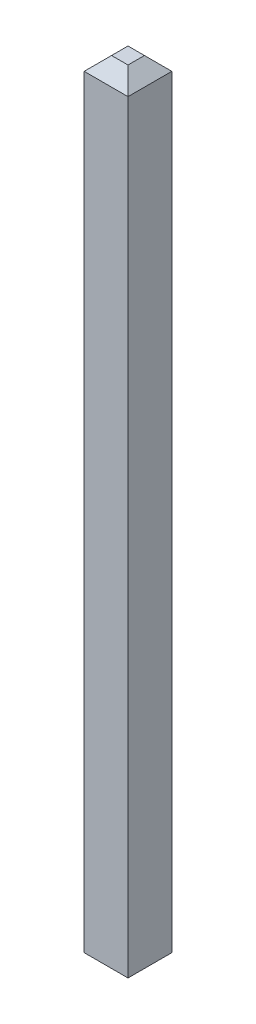
ISO-10303-21;
HEADER;
FILE_DESCRIPTION(('STEP AP214'),'2;1');
FILE_NAME('part.step','',(''),(''),'','','');
FILE_SCHEMA(('AUTOMOTIVE_DESIGN { 1 0 10303 214 1 1 1 1 }'));
ENDSEC;
DATA;
#1=APPLICATION_CONTEXT('core data for automotive mechanical design processes');
#2=APPLICATION_PROTOCOL_DEFINITION('international standard','automotive_design',2000,#1);
#3=PRODUCT_CONTEXT('',#1,'mechanical');
#4=PRODUCT('Part','Part','',(#3));
#5=PRODUCT_RELATED_PRODUCT_CATEGORY('part','',(#4));
#6=PRODUCT_DEFINITION_FORMATION('','',#4);
#7=PRODUCT_DEFINITION_CONTEXT('part definition',#1,'design');
#8=PRODUCT_DEFINITION('design','',#6,#7);
#9=PRODUCT_DEFINITION_SHAPE('','',#8);
#10=(LENGTH_UNIT() NAMED_UNIT(*) SI_UNIT(.MILLI.,.METRE.));
#11=(NAMED_UNIT(*) PLANE_ANGLE_UNIT() SI_UNIT($,.RADIAN.));
#12=(NAMED_UNIT(*) SI_UNIT($,.STERADIAN.) SOLID_ANGLE_UNIT());
#13=UNCERTAINTY_MEASURE_WITH_UNIT(LENGTH_MEASURE(1.E-05),#10,'distance_accuracy_value','');
#14=(GEOMETRIC_REPRESENTATION_CONTEXT(3) GLOBAL_UNCERTAINTY_ASSIGNED_CONTEXT((#13)) GLOBAL_UNIT_ASSIGNED_CONTEXT((#10,
#11,#12)) REPRESENTATION_CONTEXT('',''));
#15=CARTESIAN_POINT('',(0.,0.,0.));
#16=DIRECTION('',(0.,0.,1.));
#17=DIRECTION('',(1.,0.,0.));
#18=AXIS2_PLACEMENT_3D('',#15,#16,#17);
#19=CARTESIAN_POINT('',(6.67,7.07,-0.32));
#20=DIRECTION('',(-0.707106781186548,-0.707106781186548,0.));
#21=DIRECTION('',(-0.707106781186548,0.707106781186548,0.));
#22=AXIS2_PLACEMENT_3D('',#19,#20,#21);
#23=PLANE('',#22);
#24=DIRECTION('',(0.577350269189626,-0.577350269189626,0.577350269189626));
#25=VECTOR('',#24,1.);
#26=CARTESIAN_POINT('',(6.456666666667,7.283333333333,0.106666666667));
#27=LINE('',#26,#25);
#28=CARTESIAN_POINT('',(6.47,7.27,0.12));
#29=VERTEX_POINT('',#28);
#30=CARTESIAN_POINT('',(6.67,7.07,0.32));
#31=VERTEX_POINT('',#30);
#32=EDGE_CURVE('E102',#29,#31,#27,.T.);
#33=ORIENTED_EDGE('',*,*,#32,.T.);
#34=DIRECTION('',(0.,0.,1.));
#35=VECTOR('',#34,1.);
#36=CARTESIAN_POINT('',(6.67,7.07,-0.32));
#37=LINE('',#36,#35);
#38=CARTESIAN_POINT('',(6.67,7.07,-0.32));
#39=VERTEX_POINT('',#38);
#40=EDGE_CURVE('E112',#39,#31,#37,.T.);
#41=ORIENTED_EDGE('',*,*,#40,.F.);
#42=DIRECTION('',(0.577350269189626,-0.577350269189626,-0.577350269189626));
#43=VECTOR('',#42,1.);
#44=CARTESIAN_POINT('',(6.67,7.07,-0.32));
#45=LINE('',#44,#43);
#46=CARTESIAN_POINT('',(6.47,7.27,-0.12));
#47=VERTEX_POINT('',#46);
#48=EDGE_CURVE('E11',#47,#39,#45,.T.);
#49=ORIENTED_EDGE('',*,*,#48,.F.);
#50=DIRECTION('',(0.,0.,-1.));
#51=VECTOR('',#50,1.);
#52=CARTESIAN_POINT('',(6.47,7.27,-0.32));
#53=LINE('',#52,#51);
#54=EDGE_CURVE('E182',#29,#47,#53,.T.);
#55=ORIENTED_EDGE('',*,*,#54,.F.);
#56=EDGE_LOOP('',(#33,#41,#49,#55));
#57=FACE_BOUND('',#56,.T.);
#58=ADVANCED_FACE('F17',(#57),#23,.F.);
#59=CARTESIAN_POINT('',(6.35,7.07,-0.32));
#60=DIRECTION('',(0.,0.707106781186548,-0.707106781186548));
#61=DIRECTION('',(-1.,0.,0.));
#62=AXIS2_PLACEMENT_3D('',#59,#60,#61);
#63=PLANE('',#62);
#64=DIRECTION('',(0.577350269189626,0.577350269189626,0.577350269189626));
#65=VECTOR('',#64,1.);
#66=CARTESIAN_POINT('',(6.163333333333,7.203333333333,-0.186666666667));
#67=LINE('',#66,#65);
#68=CARTESIAN_POINT('',(6.03,7.07,-0.32));
#69=VERTEX_POINT('',#68);
#70=CARTESIAN_POINT('',(6.23,7.27,-0.12));
#71=VERTEX_POINT('',#70);
#72=EDGE_CURVE('E27',#69,#71,#67,.T.);
#73=ORIENTED_EDGE('',*,*,#72,.T.);
#74=DIRECTION('',(-1.,0.,0.));
#75=VECTOR('',#74,1.);
#76=CARTESIAN_POINT('',(6.03,7.27,-0.12));
#77=LINE('',#76,#75);
#78=EDGE_CURVE('E162',#47,#71,#77,.T.);
#79=ORIENTED_EDGE('',*,*,#78,.F.);
#80=ORIENTED_EDGE('',*,*,#48,.T.);
#81=DIRECTION('',(1.,0.,0.));
#82=VECTOR('',#81,1.);
#83=CARTESIAN_POINT('',(6.67,7.07,-0.32));
#84=LINE('',#83,#82);
#85=EDGE_CURVE('E132',#69,#39,#84,.T.);
#86=ORIENTED_EDGE('',*,*,#85,.F.);
#87=EDGE_LOOP('',(#73,#79,#80,#86));
#88=FACE_BOUND('',#87,.T.);
#89=ADVANCED_FACE('F207',(#88),#63,.T.);
#90=CARTESIAN_POINT('',(6.23,7.27,-0.32));
#91=DIRECTION('',(0.707106781186548,-0.707106781186548,0.));
#92=DIRECTION('',(0.,0.,-1.));
#93=AXIS2_PLACEMENT_3D('',#90,#91,#92);
#94=PLANE('',#93);
#95=DIRECTION('',(-0.577350269189626,-0.577350269189626,0.577350269189626));
#96=VECTOR('',#95,1.);
#97=CARTESIAN_POINT('',(6.163333333333,7.203333333333,0.186666666667));
#98=LINE('',#97,#96);
#99=CARTESIAN_POINT('',(6.23,7.27,0.12));
#100=VERTEX_POINT('',#99);
#101=CARTESIAN_POINT('',(6.03,7.07,0.32));
#102=VERTEX_POINT('',#101);
#103=EDGE_CURVE('E40',#100,#102,#98,.T.);
#104=ORIENTED_EDGE('',*,*,#103,.F.);
#105=DIRECTION('',(0.,0.,1.));
#106=VECTOR('',#105,1.);
#107=CARTESIAN_POINT('',(6.23,7.27,-0.32));
#108=LINE('',#107,#106);
#109=EDGE_CURVE('E159',#71,#100,#108,.T.);
#110=ORIENTED_EDGE('',*,*,#109,.F.);
#111=ORIENTED_EDGE('',*,*,#72,.F.);
#112=DIRECTION('',(0.,0.,-1.));
#113=VECTOR('',#112,1.);
#114=CARTESIAN_POINT('',(6.03,7.07,-0.32));
#115=LINE('',#114,#113);
#116=EDGE_CURVE('E115',#102,#69,#115,.T.);
#117=ORIENTED_EDGE('',*,*,#116,.F.);
#118=EDGE_LOOP('',(#104,#110,#111,#117));
#119=FACE_BOUND('',#118,.T.);
#120=ADVANCED_FACE('F116',(#119),#94,.F.);
#121=CARTESIAN_POINT('',(6.03,7.27,0.12));
#122=DIRECTION('',(0.,-0.707106781186548,-0.707106781186548));
#123=DIRECTION('',(0.,-0.707106781186548,0.707106781186548));
#124=AXIS2_PLACEMENT_3D('',#121,#122,#123);
#125=PLANE('',#124);
#126=ORIENTED_EDGE('',*,*,#32,.F.);
#127=DIRECTION('',(1.,0.,0.));
#128=VECTOR('',#127,1.);
#129=CARTESIAN_POINT('',(6.03,7.27,0.12));
#130=LINE('',#129,#128);
#131=EDGE_CURVE('E99',#100,#29,#130,.T.);
#132=ORIENTED_EDGE('',*,*,#131,.F.);
#133=ORIENTED_EDGE('',*,*,#103,.T.);
#134=DIRECTION('',(-1.,0.,0.));
#135=VECTOR('',#134,1.);
#136=CARTESIAN_POINT('',(6.35,7.07,0.32));
#137=LINE('',#136,#135);
#138=EDGE_CURVE('E96',#31,#102,#137,.T.);
#139=ORIENTED_EDGE('',*,*,#138,.F.);
#140=EDGE_LOOP('',(#126,#132,#133,#139));
#141=FACE_BOUND('',#140,.T.);
#142=ADVANCED_FACE('F95',(#141),#125,.F.);
#143=CARTESIAN_POINT('',(6.03,7.27,-0.32));
#144=DIRECTION('',(0.,-1.,0.));
#145=DIRECTION('',(0.,0.,-1.));
#146=AXIS2_PLACEMENT_3D('',#143,#144,#145);
#147=PLANE('',#146);
#148=ORIENTED_EDGE('',*,*,#54,.T.);
#149=ORIENTED_EDGE('',*,*,#78,.T.);
#150=ORIENTED_EDGE('',*,*,#109,.T.);
#151=ORIENTED_EDGE('',*,*,#131,.T.);
#152=EDGE_LOOP('',(#148,#149,#150,#151));
#153=FACE_BOUND('',#152,.T.);
#154=ADVANCED_FACE('F209',(#153),#147,.F.);
#155=CARTESIAN_POINT('',(6.67,7.27,-0.32));
#156=DIRECTION('',(-1.,0.,0.));
#157=DIRECTION('',(0.,1.,0.));
#158=AXIS2_PLACEMENT_3D('',#155,#156,#157);
#159=PLANE('',#158);
#160=DIRECTION('',(0.,-1.,0.));
#161=VECTOR('',#160,1.);
#162=CARTESIAN_POINT('',(6.67,7.27,-0.32));
#163=LINE('',#162,#161);
#164=CARTESIAN_POINT('',(6.67,-4.07,-0.32));
#165=VERTEX_POINT('',#164);
#166=EDGE_CURVE('E126',#39,#165,#163,.T.);
#167=ORIENTED_EDGE('',*,*,#166,.F.);
#168=ORIENTED_EDGE('',*,*,#40,.T.);
#169=DIRECTION('',(0.,-1.,0.));
#170=VECTOR('',#169,1.);
#171=CARTESIAN_POINT('',(6.67,7.27,0.32));
#172=LINE('',#171,#170);
#173=CARTESIAN_POINT('',(6.67,-4.07,0.32));
#174=VERTEX_POINT('',#173);
#175=EDGE_CURVE('E110',#31,#174,#172,.T.);
#176=ORIENTED_EDGE('',*,*,#175,.T.);
#177=DIRECTION('',(0.,0.,-1.));
#178=VECTOR('',#177,1.);
#179=CARTESIAN_POINT('',(6.67,-4.07,-0.32));
#180=LINE('',#179,#178);
#181=EDGE_CURVE('E194',#174,#165,#180,.T.);
#182=ORIENTED_EDGE('',*,*,#181,.T.);
#183=EDGE_LOOP('',(#167,#168,#176,#182));
#184=FACE_BOUND('',#183,.T.);
#185=ADVANCED_FACE('F19',(#184),#159,.F.);
#186=CARTESIAN_POINT('',(6.35,1.5,0.32));
#187=DIRECTION('',(0.,0.,-1.));
#188=DIRECTION('',(0.,-1.,0.));
#189=AXIS2_PLACEMENT_3D('',#186,#187,#188);
#190=PLANE('',#189);
#191=ORIENTED_EDGE('',*,*,#175,.F.);
#192=ORIENTED_EDGE('',*,*,#138,.T.);
#193=DIRECTION('',(0.,1.,0.));
#194=VECTOR('',#193,1.);
#195=CARTESIAN_POINT('',(6.03,-4.27,0.32));
#196=LINE('',#195,#194);
#197=CARTESIAN_POINT('',(6.03,-4.07,0.32));
#198=VERTEX_POINT('',#197);
#199=EDGE_CURVE('E109',#198,#102,#196,.T.);
#200=ORIENTED_EDGE('',*,*,#199,.F.);
#201=DIRECTION('',(1.,0.,0.));
#202=VECTOR('',#201,1.);
#203=CARTESIAN_POINT('',(6.35,-4.07,0.32));
#204=LINE('',#203,#202);
#205=EDGE_CURVE('E191',#198,#174,#204,.T.);
#206=ORIENTED_EDGE('',*,*,#205,.T.);
#207=EDGE_LOOP('',(#191,#192,#200,#206));
#208=FACE_BOUND('',#207,.T.);
#209=ADVANCED_FACE('F106',(#208),#190,.F.);
#210=CARTESIAN_POINT('',(6.47,-4.27,-0.32));
#211=DIRECTION('',(-0.707106781186548,0.707106781186548,0.));
#212=DIRECTION('',(0.,0.,1.));
#213=AXIS2_PLACEMENT_3D('',#210,#211,#212);
#214=PLANE('',#213);
#215=DIRECTION('',(-0.577350269189626,-0.577350269189626,0.577350269189626));
#216=VECTOR('',#215,1.);
#217=CARTESIAN_POINT('',(6.536666666667,-4.203333333333,-0.186666666667));
#218=LINE('',#217,#216);
#219=CARTESIAN_POINT('',(6.47,-4.27,-0.12));
#220=VERTEX_POINT('',#219);
#221=EDGE_CURVE('E169',#165,#220,#218,.T.);
#222=ORIENTED_EDGE('',*,*,#221,.F.);
#223=ORIENTED_EDGE('',*,*,#181,.F.);
#224=DIRECTION('',(-0.577350269189626,-0.577350269189626,-0.577350269189626));
#225=VECTOR('',#224,1.);
#226=CARTESIAN_POINT('',(6.323333333333,-4.416666666667,-0.02666666666667));
#227=LINE('',#226,#225);
#228=CARTESIAN_POINT('',(6.47,-4.27,0.12));
#229=VERTEX_POINT('',#228);
#230=EDGE_CURVE('E158',#174,#229,#227,.T.);
#231=ORIENTED_EDGE('',*,*,#230,.T.);
#232=DIRECTION('',(0.,0.,1.));
#233=VECTOR('',#232,1.);
#234=CARTESIAN_POINT('',(6.47,-4.27,-0.32));
#235=LINE('',#234,#233);
#236=EDGE_CURVE('E139',#220,#229,#235,.T.);
#237=ORIENTED_EDGE('',*,*,#236,.F.);
#238=EDGE_LOOP('',(#222,#223,#231,#237));
#239=FACE_BOUND('',#238,.T.);
#240=ADVANCED_FACE('F237',(#239),#214,.F.);
#241=CARTESIAN_POINT('',(6.67,-4.27,0.12));
#242=DIRECTION('',(0.,0.707106781186548,-0.707106781186548));
#243=DIRECTION('',(-1.,0.,0.));
#244=AXIS2_PLACEMENT_3D('',#241,#242,#243);
#245=PLANE('',#244);
#246=ORIENTED_EDGE('',*,*,#230,.F.);
#247=ORIENTED_EDGE('',*,*,#205,.F.);
#248=DIRECTION('',(-0.577350269189626,0.577350269189626,0.577350269189626));
#249=VECTOR('',#248,1.);
#250=CARTESIAN_POINT('',(6.243333333333,-4.283333333333,0.106666666667));
#251=LINE('',#250,#249);
#252=CARTESIAN_POINT('',(6.23,-4.27,0.12));
#253=VERTEX_POINT('',#252);
#254=EDGE_CURVE('E154',#253,#198,#251,.T.);
#255=ORIENTED_EDGE('',*,*,#254,.F.);
#256=DIRECTION('',(-1.,0.,0.));
#257=VECTOR('',#256,1.);
#258=CARTESIAN_POINT('',(6.67,-4.27,0.12));
#259=LINE('',#258,#257);
#260=EDGE_CURVE('E143',#229,#253,#259,.T.);
#261=ORIENTED_EDGE('',*,*,#260,.F.);
#262=EDGE_LOOP('',(#246,#247,#255,#261));
#263=FACE_BOUND('',#262,.T.);
#264=ADVANCED_FACE('F241',(#263),#245,.F.);
#265=CARTESIAN_POINT('',(6.03,-4.07,-0.32));
#266=DIRECTION('',(0.707106781186548,0.707106781186548,0.));
#267=DIRECTION('',(0.,0.,-1.));
#268=AXIS2_PLACEMENT_3D('',#265,#266,#267);
#269=PLANE('',#268);
#270=DIRECTION('',(0.577350269189626,-0.577350269189626,0.577350269189626));
#271=VECTOR('',#270,1.);
#272=CARTESIAN_POINT('',(6.136666666667,-4.176666666667,-0.213333333333));
#273=LINE('',#272,#271);
#274=CARTESIAN_POINT('',(6.03,-4.07,-0.32));
#275=VERTEX_POINT('',#274);
#276=CARTESIAN_POINT('',(6.23,-4.27,-0.12));
#277=VERTEX_POINT('',#276);
#278=EDGE_CURVE('E135',#275,#277,#273,.T.);
#279=ORIENTED_EDGE('',*,*,#278,.T.);
#280=DIRECTION('',(0.,0.,-1.));
#281=VECTOR('',#280,1.);
#282=CARTESIAN_POINT('',(6.23,-4.27,-0.32));
#283=LINE('',#282,#281);
#284=EDGE_CURVE('E150',#253,#277,#283,.T.);
#285=ORIENTED_EDGE('',*,*,#284,.F.);
#286=ORIENTED_EDGE('',*,*,#254,.T.);
#287=DIRECTION('',(0.,0.,1.));
#288=VECTOR('',#287,1.);
#289=CARTESIAN_POINT('',(6.03,-4.07,-0.32));
#290=LINE('',#289,#288);
#291=EDGE_CURVE('E121',#275,#198,#290,.T.);
#292=ORIENTED_EDGE('',*,*,#291,.F.);
#293=EDGE_LOOP('',(#279,#285,#286,#292));
#294=FACE_BOUND('',#293,.T.);
#295=ADVANCED_FACE('F243',(#294),#269,.F.);
#296=CARTESIAN_POINT('',(6.03,-4.27,-0.32));
#297=DIRECTION('',(1.,0.,0.));
#298=DIRECTION('',(0.,0.,1.));
#299=AXIS2_PLACEMENT_3D('',#296,#297,#298);
#300=PLANE('',#299);
#301=ORIENTED_EDGE('',*,*,#199,.T.);
#302=ORIENTED_EDGE('',*,*,#116,.T.);
#303=DIRECTION('',(0.,1.,0.));
#304=VECTOR('',#303,1.);
#305=CARTESIAN_POINT('',(6.03,-4.27,-0.32));
#306=LINE('',#305,#304);
#307=EDGE_CURVE('E170',#275,#69,#306,.T.);
#308=ORIENTED_EDGE('',*,*,#307,.F.);
#309=ORIENTED_EDGE('',*,*,#291,.T.);
#310=EDGE_LOOP('',(#301,#302,#308,#309));
#311=FACE_BOUND('',#310,.T.);
#312=ADVANCED_FACE('F124',(#311),#300,.F.);
#313=CARTESIAN_POINT('',(6.35,1.5,-0.32));
#314=DIRECTION('',(0.,0.,-1.));
#315=DIRECTION('',(0.,-1.,0.));
#316=AXIS2_PLACEMENT_3D('',#313,#314,#315);
#317=PLANE('',#316);
#318=ORIENTED_EDGE('',*,*,#307,.T.);
#319=ORIENTED_EDGE('',*,*,#85,.T.);
#320=ORIENTED_EDGE('',*,*,#166,.T.);
#321=DIRECTION('',(-1.,0.,0.));
#322=VECTOR('',#321,1.);
#323=CARTESIAN_POINT('',(6.03,-4.07,-0.32));
#324=LINE('',#323,#322);
#325=EDGE_CURVE('E137',#165,#275,#324,.T.);
#326=ORIENTED_EDGE('',*,*,#325,.T.);
#327=EDGE_LOOP('',(#318,#319,#320,#326));
#328=FACE_BOUND('',#327,.T.);
#329=ADVANCED_FACE('F245',(#328),#317,.T.);
#330=CARTESIAN_POINT('',(6.35,-4.07,-0.32));
#331=DIRECTION('',(0.,-0.707106781186548,-0.707106781186548));
#332=DIRECTION('',(0.,-0.707106781186548,0.707106781186548));
#333=AXIS2_PLACEMENT_3D('',#330,#331,#332);
#334=PLANE('',#333);
#335=ORIENTED_EDGE('',*,*,#278,.F.);
#336=ORIENTED_EDGE('',*,*,#325,.F.);
#337=ORIENTED_EDGE('',*,*,#221,.T.);
#338=DIRECTION('',(1.,0.,0.));
#339=VECTOR('',#338,1.);
#340=CARTESIAN_POINT('',(6.67,-4.27,-0.12));
#341=LINE('',#340,#339);
#342=EDGE_CURVE('E138',#277,#220,#341,.T.);
#343=ORIENTED_EDGE('',*,*,#342,.F.);
#344=EDGE_LOOP('',(#335,#336,#337,#343));
#345=FACE_BOUND('',#344,.T.);
#346=ADVANCED_FACE('F230',(#345),#334,.T.);
#347=CARTESIAN_POINT('',(6.67,-4.27,-0.32));
#348=DIRECTION('',(0.,1.,0.));
#349=DIRECTION('',(0.,0.,-1.));
#350=AXIS2_PLACEMENT_3D('',#347,#348,#349);
#351=PLANE('',#350);
#352=ORIENTED_EDGE('',*,*,#236,.T.);
#353=ORIENTED_EDGE('',*,*,#260,.T.);
#354=ORIENTED_EDGE('',*,*,#284,.T.);
#355=ORIENTED_EDGE('',*,*,#342,.T.);
#356=EDGE_LOOP('',(#352,#353,#354,#355));
#357=FACE_BOUND('',#356,.T.);
#358=ADVANCED_FACE('F235',(#357),#351,.F.);
#359=CLOSED_SHELL('',(#58,#89,#120,#142,#154,#185,#209,#240,#264,#295,#312,#329,#346,#358));
#360=MANIFOLD_SOLID_BREP('B1',#359);
#361=ADVANCED_BREP_SHAPE_REPRESENTATION('',(#18,#360),#14);
#362=SHAPE_DEFINITION_REPRESENTATION(#9,#361);
ENDSEC;
END-ISO-10303-21;
